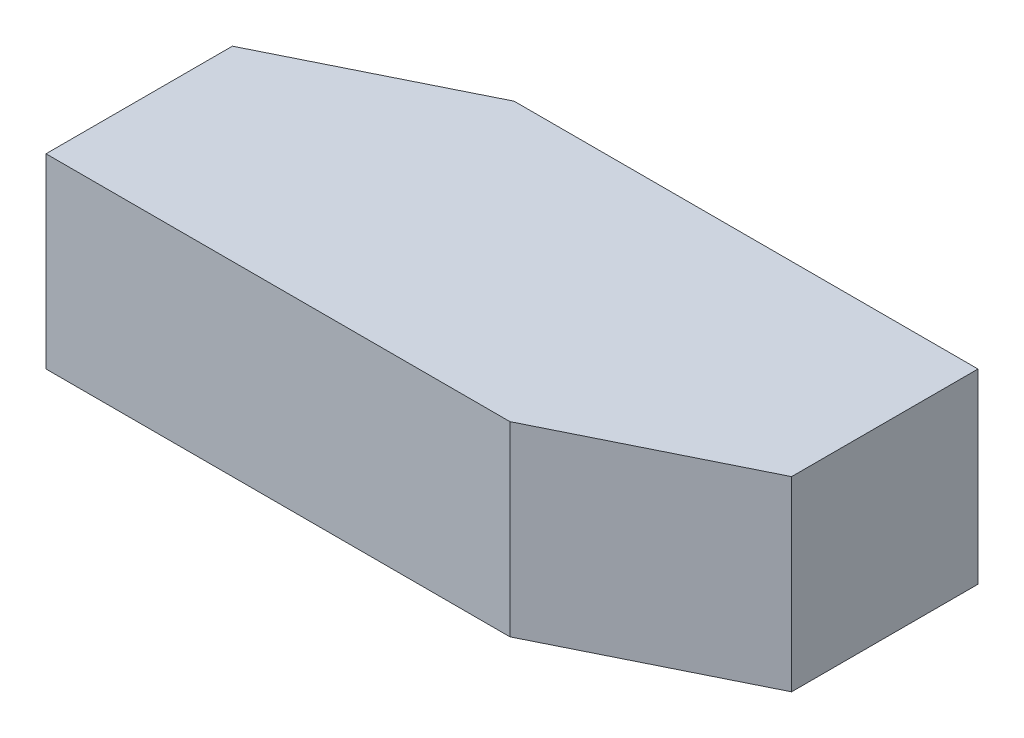
ISO-10303-21;
HEADER;
FILE_DESCRIPTION(('STEP AP214'),'2;1');
FILE_NAME('part.step','',(''),(''),'','','');
FILE_SCHEMA(('AUTOMOTIVE_DESIGN { 1 0 10303 214 1 1 1 1 }'));
ENDSEC;
DATA;
#1=APPLICATION_CONTEXT('core data for automotive mechanical design processes');
#2=APPLICATION_PROTOCOL_DEFINITION('international standard','automotive_design',2000,#1);
#3=PRODUCT_CONTEXT('',#1,'mechanical');
#4=PRODUCT('Part','Part','',(#3));
#5=PRODUCT_RELATED_PRODUCT_CATEGORY('part','',(#4));
#6=PRODUCT_DEFINITION_FORMATION('','',#4);
#7=PRODUCT_DEFINITION_CONTEXT('part definition',#1,'design');
#8=PRODUCT_DEFINITION('design','',#6,#7);
#9=PRODUCT_DEFINITION_SHAPE('','',#8);
#10=(LENGTH_UNIT() NAMED_UNIT(*) SI_UNIT(.MILLI.,.METRE.));
#11=(NAMED_UNIT(*) PLANE_ANGLE_UNIT() SI_UNIT($,.RADIAN.));
#12=(NAMED_UNIT(*) SI_UNIT($,.STERADIAN.) SOLID_ANGLE_UNIT());
#13=UNCERTAINTY_MEASURE_WITH_UNIT(LENGTH_MEASURE(1.E-05),#10,'distance_accuracy_value','');
#14=(GEOMETRIC_REPRESENTATION_CONTEXT(3) GLOBAL_UNCERTAINTY_ASSIGNED_CONTEXT((#13)) GLOBAL_UNIT_ASSIGNED_CONTEXT((#10,
#11,#12)) REPRESENTATION_CONTEXT('',''));
#15=CARTESIAN_POINT('',(0.,0.,0.));
#16=DIRECTION('',(0.,0.,1.));
#17=DIRECTION('',(1.,0.,0.));
#18=AXIS2_PLACEMENT_3D('',#15,#16,#17);
#19=CARTESIAN_POINT('',(-4.71584145487512,4.,23.6516397081537));
#20=DIRECTION('',(-0.443252074898679,0.,-0.896397009197386));
#21=DIRECTION('',(-0.89639700919739,0.,0.443252074898677));
#22=AXIS2_PLACEMENT_3D('',#19,#20,#21);
#23=PLANE('',#22);
#24=DIRECTION('',(0.89639700919739,0.,-0.443252074898677));
#25=VECTOR('',#24,1.);
#26=CARTESIAN_POINT('',(-4.71584145487512,0.,23.6516397081537));
#27=LINE('',#26,#25);
#28=CARTESIAN_POINT('',(-4.71584145487512,0.,23.6516397081537));
#29=VERTEX_POINT('',#28);
#30=CARTESIAN_POINT('',(-0.671203832356172,0.,21.6516397081537));
#31=VERTEX_POINT('',#30);
#32=EDGE_CURVE('E116',#29,#31,#27,.T.);
#33=ORIENTED_EDGE('',*,*,#32,.T.);
#34=DIRECTION('',(0.,-1.,0.));
#35=VECTOR('',#34,1.);
#36=CARTESIAN_POINT('',(-0.671203832356172,4.,21.6516397081537));
#37=LINE('',#36,#35);
#38=CARTESIAN_POINT('',(-0.671203832356172,4.,21.6516397081537));
#39=VERTEX_POINT('',#38);
#40=EDGE_CURVE('E11',#39,#31,#37,.T.);
#41=ORIENTED_EDGE('',*,*,#40,.F.);
#42=DIRECTION('',(0.89639700919739,0.,-0.443252074898677));
#43=VECTOR('',#42,1.);
#44=CARTESIAN_POINT('',(-4.71584145487512,4.,23.6516397081537));
#45=LINE('',#44,#43);
#46=CARTESIAN_POINT('',(-4.71584145487512,4.,23.6516397081537));
#47=VERTEX_POINT('',#46);
#48=EDGE_CURVE('E126',#47,#39,#45,.T.);
#49=ORIENTED_EDGE('',*,*,#48,.F.);
#50=DIRECTION('',(0.,-1.,0.));
#51=VECTOR('',#50,1.);
#52=CARTESIAN_POINT('',(-4.71584145487512,4.,23.6516397081537));
#53=LINE('',#52,#51);
#54=EDGE_CURVE('E112',#47,#29,#53,.T.);
#55=ORIENTED_EDGE('',*,*,#54,.T.);
#56=EDGE_LOOP('',(#33,#41,#49,#55));
#57=FACE_BOUND('',#56,.T.);
#58=ADVANCED_FACE('F32',(#57),#23,.F.);
#59=CARTESIAN_POINT('',(-0.671203832356172,4.,21.6516397081537));
#60=DIRECTION('',(-1.,0.,0.));
#61=DIRECTION('',(0.,0.,1.));
#62=AXIS2_PLACEMENT_3D('',#59,#60,#61);
#63=PLANE('',#62);
#64=DIRECTION('',(0.,0.,-1.));
#65=VECTOR('',#64,1.);
#66=CARTESIAN_POINT('',(-0.671203832356172,0.,21.6516397081537));
#67=LINE('',#66,#65);
#68=CARTESIAN_POINT('',(-0.671203832356172,0.,17.6516397081537));
#69=VERTEX_POINT('',#68);
#70=EDGE_CURVE('E119',#31,#69,#67,.T.);
#71=ORIENTED_EDGE('',*,*,#70,.T.);
#72=DIRECTION('',(0.,-1.,0.));
#73=VECTOR('',#72,1.);
#74=CARTESIAN_POINT('',(-0.671203832356172,4.,17.6516397081537));
#75=LINE('',#74,#73);
#76=CARTESIAN_POINT('',(-0.671203832356172,4.,17.6516397081537));
#77=VERTEX_POINT('',#76);
#78=EDGE_CURVE('E40',#77,#69,#75,.T.);
#79=ORIENTED_EDGE('',*,*,#78,.F.);
#80=DIRECTION('',(0.,0.,-1.));
#81=VECTOR('',#80,1.);
#82=CARTESIAN_POINT('',(-0.671203832356172,4.,21.6516397081537));
#83=LINE('',#82,#81);
#84=EDGE_CURVE('E85',#39,#77,#83,.T.);
#85=ORIENTED_EDGE('',*,*,#84,.F.);
#86=ORIENTED_EDGE('',*,*,#40,.T.);
#87=EDGE_LOOP('',(#71,#79,#85,#86));
#88=FACE_BOUND('',#87,.T.);
#89=ADVANCED_FACE('F150',(#88),#63,.F.);
#90=CARTESIAN_POINT('',(-0.671203832356172,4.,17.6516397081537));
#91=DIRECTION('',(0.,0.,1.));
#92=DIRECTION('',(1.,0.,0.));
#93=AXIS2_PLACEMENT_3D('',#90,#91,#92);
#94=PLANE('',#93);
#95=DIRECTION('',(-1.,0.,0.));
#96=VECTOR('',#95,1.);
#97=CARTESIAN_POINT('',(-0.671203832356172,0.,17.6516397081537));
#98=LINE('',#97,#96);
#99=CARTESIAN_POINT('',(-10.6265662098373,0.,17.6516397081537));
#100=VERTEX_POINT('',#99);
#101=EDGE_CURVE('E121',#69,#100,#98,.T.);
#102=ORIENTED_EDGE('',*,*,#101,.T.);
#103=DIRECTION('',(0.,-1.,0.));
#104=VECTOR('',#103,1.);
#105=CARTESIAN_POINT('',(-10.6265662098373,4.,17.6516397081537));
#106=LINE('',#105,#104);
#107=CARTESIAN_POINT('',(-10.6265662098373,4.,17.6516397081537));
#108=VERTEX_POINT('',#107);
#109=EDGE_CURVE('E107',#108,#100,#106,.T.);
#110=ORIENTED_EDGE('',*,*,#109,.F.);
#111=DIRECTION('',(-1.,0.,0.));
#112=VECTOR('',#111,1.);
#113=CARTESIAN_POINT('',(-0.671203832356172,4.,17.6516397081537));
#114=LINE('',#113,#112);
#115=EDGE_CURVE('E98',#77,#108,#114,.T.);
#116=ORIENTED_EDGE('',*,*,#115,.F.);
#117=ORIENTED_EDGE('',*,*,#78,.T.);
#118=EDGE_LOOP('',(#102,#110,#116,#117));
#119=FACE_BOUND('',#118,.T.);
#120=ADVANCED_FACE('F132',(#119),#94,.F.);
#121=CARTESIAN_POINT('',(-10.6265662098373,4.,17.6516397081537));
#122=DIRECTION('',(0.443252074898678,0.,0.896397009197386));
#123=DIRECTION('',(0.896397009197391,0.,-0.443252074898676));
#124=AXIS2_PLACEMENT_3D('',#121,#122,#123);
#125=PLANE('',#124);
#126=DIRECTION('',(-0.89639700919739,0.,0.443252074898676));
#127=VECTOR('',#126,1.);
#128=CARTESIAN_POINT('',(-10.6265662098373,0.,17.6516397081537));
#129=LINE('',#128,#127);
#130=CARTESIAN_POINT('',(-14.6712038323563,0.,19.6516397081537));
#131=VERTEX_POINT('',#130);
#132=EDGE_CURVE('E106',#100,#131,#129,.T.);
#133=ORIENTED_EDGE('',*,*,#132,.T.);
#134=DIRECTION('',(0.,-1.,0.));
#135=VECTOR('',#134,1.);
#136=CARTESIAN_POINT('',(-14.6712038323563,4.,19.6516397081537));
#137=LINE('',#136,#135);
#138=CARTESIAN_POINT('',(-14.6712038323563,4.,19.6516397081537));
#139=VERTEX_POINT('',#138);
#140=EDGE_CURVE('E103',#139,#131,#137,.T.);
#141=ORIENTED_EDGE('',*,*,#140,.F.);
#142=DIRECTION('',(-0.89639700919739,0.,0.443252074898676));
#143=VECTOR('',#142,1.);
#144=CARTESIAN_POINT('',(-10.6265662098373,4.,17.6516397081537));
#145=LINE('',#144,#143);
#146=EDGE_CURVE('E92',#108,#139,#145,.T.);
#147=ORIENTED_EDGE('',*,*,#146,.F.);
#148=ORIENTED_EDGE('',*,*,#109,.T.);
#149=EDGE_LOOP('',(#133,#141,#147,#148));
#150=FACE_BOUND('',#149,.T.);
#151=ADVANCED_FACE('F104',(#150),#125,.F.);
#152=CARTESIAN_POINT('',(-14.6712038323563,4.,19.6516397081537));
#153=DIRECTION('',(1.,0.,0.));
#154=DIRECTION('',(0.,0.,-1.));
#155=AXIS2_PLACEMENT_3D('',#152,#153,#154);
#156=PLANE('',#155);
#157=DIRECTION('',(0.,0.,1.));
#158=VECTOR('',#157,1.);
#159=CARTESIAN_POINT('',(-14.6712038323563,0.,19.6516397081537));
#160=LINE('',#159,#158);
#161=CARTESIAN_POINT('',(-14.6712038323563,0.,23.6516397081537));
#162=VERTEX_POINT('',#161);
#163=EDGE_CURVE('E71',#131,#162,#160,.T.);
#164=ORIENTED_EDGE('',*,*,#163,.T.);
#165=DIRECTION('',(0.,-1.,0.));
#166=VECTOR('',#165,1.);
#167=CARTESIAN_POINT('',(-14.6712038323563,4.,23.6516397081537));
#168=LINE('',#167,#166);
#169=CARTESIAN_POINT('',(-14.6712038323563,4.,23.6516397081537));
#170=VERTEX_POINT('',#169);
#171=EDGE_CURVE('E108',#170,#162,#168,.T.);
#172=ORIENTED_EDGE('',*,*,#171,.F.);
#173=DIRECTION('',(0.,0.,1.));
#174=VECTOR('',#173,1.);
#175=CARTESIAN_POINT('',(-14.6712038323563,4.,19.6516397081537));
#176=LINE('',#175,#174);
#177=EDGE_CURVE('E96',#139,#170,#176,.T.);
#178=ORIENTED_EDGE('',*,*,#177,.F.);
#179=ORIENTED_EDGE('',*,*,#140,.T.);
#180=EDGE_LOOP('',(#164,#172,#178,#179));
#181=FACE_BOUND('',#180,.T.);
#182=ADVANCED_FACE('F110',(#181),#156,.F.);
#183=CARTESIAN_POINT('',(-14.6712038323563,4.,23.6516397081537));
#184=DIRECTION('',(0.,0.,-1.));
#185=DIRECTION('',(-1.,0.,0.));
#186=AXIS2_PLACEMENT_3D('',#183,#184,#185);
#187=PLANE('',#186);
#188=DIRECTION('',(1.,0.,0.));
#189=VECTOR('',#188,1.);
#190=CARTESIAN_POINT('',(-14.6712038323563,0.,23.6516397081537));
#191=LINE('',#190,#189);
#192=EDGE_CURVE('E77',#162,#29,#191,.T.);
#193=ORIENTED_EDGE('',*,*,#192,.T.);
#194=ORIENTED_EDGE('',*,*,#54,.F.);
#195=DIRECTION('',(1.,0.,0.));
#196=VECTOR('',#195,1.);
#197=CARTESIAN_POINT('',(-14.6712038323563,4.,23.6516397081537));
#198=LINE('',#197,#196);
#199=EDGE_CURVE('E48',#170,#47,#198,.T.);
#200=ORIENTED_EDGE('',*,*,#199,.F.);
#201=ORIENTED_EDGE('',*,*,#171,.T.);
#202=EDGE_LOOP('',(#193,#194,#200,#201));
#203=FACE_BOUND('',#202,.T.);
#204=ADVANCED_FACE('F139',(#203),#187,.F.);
#205=CARTESIAN_POINT('',(0.,4.,0.));
#206=DIRECTION('',(0.,1.,0.));
#207=DIRECTION('',(0.,0.,1.));
#208=AXIS2_PLACEMENT_3D('',#205,#206,#207);
#209=PLANE('',#208);
#210=ORIENTED_EDGE('',*,*,#48,.T.);
#211=ORIENTED_EDGE('',*,*,#84,.T.);
#212=ORIENTED_EDGE('',*,*,#115,.T.);
#213=ORIENTED_EDGE('',*,*,#146,.T.);
#214=ORIENTED_EDGE('',*,*,#177,.T.);
#215=ORIENTED_EDGE('',*,*,#199,.T.);
#216=EDGE_LOOP('',(#210,#211,#212,#213,#214,#215));
#217=FACE_BOUND('',#216,.T.);
#218=ADVANCED_FACE('F94',(#217),#209,.T.);
#219=CARTESIAN_POINT('',(0.,0.,0.));
#220=DIRECTION('',(0.,1.,0.));
#221=DIRECTION('',(0.,0.,1.));
#222=AXIS2_PLACEMENT_3D('',#219,#220,#221);
#223=PLANE('',#222);
#224=ORIENTED_EDGE('',*,*,#32,.F.);
#225=ORIENTED_EDGE('',*,*,#192,.F.);
#226=ORIENTED_EDGE('',*,*,#163,.F.);
#227=ORIENTED_EDGE('',*,*,#132,.F.);
#228=ORIENTED_EDGE('',*,*,#101,.F.);
#229=ORIENTED_EDGE('',*,*,#70,.F.);
#230=EDGE_LOOP('',(#224,#225,#226,#227,#228,#229));
#231=FACE_BOUND('',#230,.T.);
#232=ADVANCED_FACE('F135',(#231),#223,.F.);
#233=CLOSED_SHELL('',(#58,#89,#120,#151,#182,#204,#218,#232));
#234=MANIFOLD_SOLID_BREP('B2',#233);
#235=ADVANCED_BREP_SHAPE_REPRESENTATION('',(#18,#234),#14);
#236=SHAPE_DEFINITION_REPRESENTATION(#9,#235);
ENDSEC;
END-ISO-10303-21;
